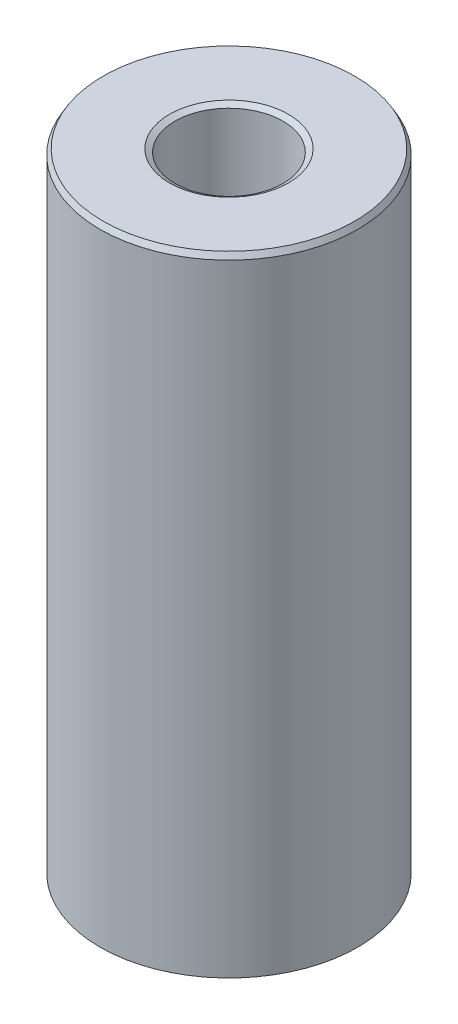
ISO-10303-21;
HEADER;
FILE_DESCRIPTION(('STEP AP214'),'2;1');
FILE_NAME('part.step','',(''),(''),'','','');
FILE_SCHEMA(('AUTOMOTIVE_DESIGN { 1 0 10303 214 1 1 1 1 }'));
ENDSEC;
DATA;
#1=APPLICATION_CONTEXT('core data for automotive mechanical design processes');
#2=APPLICATION_PROTOCOL_DEFINITION('international standard','automotive_design',2000,#1);
#3=PRODUCT_CONTEXT('',#1,'mechanical');
#4=PRODUCT('Part','Part','',(#3));
#5=PRODUCT_RELATED_PRODUCT_CATEGORY('part','',(#4));
#6=PRODUCT_DEFINITION_FORMATION('','',#4);
#7=PRODUCT_DEFINITION_CONTEXT('part definition',#1,'design');
#8=PRODUCT_DEFINITION('design','',#6,#7);
#9=PRODUCT_DEFINITION_SHAPE('','',#8);
#10=(LENGTH_UNIT() NAMED_UNIT(*) SI_UNIT(.MILLI.,.METRE.));
#11=(NAMED_UNIT(*) PLANE_ANGLE_UNIT() SI_UNIT($,.RADIAN.));
#12=(NAMED_UNIT(*) SI_UNIT($,.STERADIAN.) SOLID_ANGLE_UNIT());
#13=UNCERTAINTY_MEASURE_WITH_UNIT(LENGTH_MEASURE(1.E-05),#10,'distance_accuracy_value','');
#14=(GEOMETRIC_REPRESENTATION_CONTEXT(3) GLOBAL_UNCERTAINTY_ASSIGNED_CONTEXT((#13)) GLOBAL_UNIT_ASSIGNED_CONTEXT((#10,
#11,#12)) REPRESENTATION_CONTEXT('',''));
#15=CARTESIAN_POINT('',(0.,0.,0.));
#16=DIRECTION('',(0.,0.,1.));
#17=DIRECTION('',(1.,0.,0.));
#18=AXIS2_PLACEMENT_3D('',#15,#16,#17);
#19=CARTESIAN_POINT('',(0.,232.264597677839,0.));
#20=DIRECTION('',(0.,-1.,0.));
#21=DIRECTION('',(0.,0.,-1.));
#22=AXIS2_PLACEMENT_3D('',#19,#20,#21);
#23=CYLINDRICAL_SURFACE('',#22,47.5);
#24=CARTESIAN_POINT('',(0.,1.16837928120325,0.));
#25=DIRECTION('',(0.,1.,0.));
#26=DIRECTION('',(0.,0.,1.));
#27=AXIS2_PLACEMENT_3D('',#24,#25,#26);
#28=CIRCLE('',#27,47.5);
#29=CARTESIAN_POINT('',(0.,1.16837928120325,47.5));
#30=VERTEX_POINT('',#29);
#31=EDGE_CURVE('E10',#30,#30,#28,.T.);
#32=ORIENTED_EDGE('',*,*,#31,.T.);
#33=EDGE_LOOP('',(#32));
#34=FACE_BOUND('',#33,.T.);
#35=CARTESIAN_POINT('',(0.,230.240905400284,0.));
#36=DIRECTION('',(0.,1.,0.));
#37=DIRECTION('',(0.,0.,1.));
#38=AXIS2_PLACEMENT_3D('',#35,#36,#37);
#39=CIRCLE('',#38,47.5);
#40=CARTESIAN_POINT('',(0.,230.240905400284,47.5));
#41=VERTEX_POINT('',#40);
#42=EDGE_CURVE('E50',#41,#41,#39,.F.);
#43=ORIENTED_EDGE('',*,*,#42,.T.);
#44=EDGE_LOOP('',(#43));
#45=FACE_BOUND('',#44,.T.);
#46=ADVANCED_FACE('F39',(#34,#45),#23,.T.);
#47=CARTESIAN_POINT('',(0.,232.264597677839,0.));
#48=DIRECTION('',(0.,1.,0.));
#49=DIRECTION('',(0.,0.,1.));
#50=AXIS2_PLACEMENT_3D('',#47,#48,#49);
#51=PLANE('',#50);
#52=CARTESIAN_POINT('',(0.,232.264597677839,0.));
#53=DIRECTION('',(0.,1.,0.));
#54=DIRECTION('',(0.,0.,1.));
#55=AXIS2_PLACEMENT_3D('',#52,#53,#54);
#56=CIRCLE('',#55,21.9333346796336);
#57=CARTESIAN_POINT('',(0.,232.264597677839,21.9333346796336));
#58=VERTEX_POINT('',#57);
#59=EDGE_CURVE('E58',#58,#58,#56,.F.);
#60=ORIENTED_EDGE('',*,*,#59,.T.);
#61=EDGE_LOOP('',(#60));
#62=FACE_BOUND('',#61,.T.);
#63=CARTESIAN_POINT('',(0.,232.264597677839,0.));
#64=DIRECTION('',(0.,1.,0.));
#65=DIRECTION('',(0.,0.,1.));
#66=AXIS2_PLACEMENT_3D('',#63,#64,#65);
#67=CIRCLE('',#66,46.3316207187967);
#68=CARTESIAN_POINT('',(0.,232.264597677839,46.3316207187967));
#69=VERTEX_POINT('',#68);
#70=EDGE_CURVE('E61',#69,#69,#67,.T.);
#71=ORIENTED_EDGE('',*,*,#70,.T.);
#72=EDGE_LOOP('',(#71));
#73=FACE_BOUND('',#72,.T.);
#74=ADVANCED_FACE('F88',(#62,#73),#51,.T.);
#75=CARTESIAN_POINT('',(0.,0.,0.));
#76=DIRECTION('',(0.,1.,0.));
#77=DIRECTION('',(0.,0.,1.));
#78=AXIS2_PLACEMENT_3D('',#75,#76,#77);
#79=PLANE('',#78);
#80=CARTESIAN_POINT('',(0.,0.,0.));
#81=DIRECTION('',(0.,1.,0.));
#82=DIRECTION('',(0.,0.,1.));
#83=AXIS2_PLACEMENT_3D('',#80,#81,#82);
#84=CIRCLE('',#83,21.078021683282);
#85=CARTESIAN_POINT('',(0.,0.,21.078021683282));
#86=VERTEX_POINT('',#85);
#87=EDGE_CURVE('E51',#86,#86,#84,.T.);
#88=ORIENTED_EDGE('',*,*,#87,.T.);
#89=EDGE_LOOP('',(#88));
#90=FACE_BOUND('',#89,.T.);
#91=CARTESIAN_POINT('',(0.,0.,0.));
#92=DIRECTION('',(0.,1.,0.));
#93=DIRECTION('',(0.,0.,1.));
#94=AXIS2_PLACEMENT_3D('',#91,#92,#93);
#95=CIRCLE('',#94,45.4763077224452);
#96=CARTESIAN_POINT('',(0.,0.,45.4763077224452));
#97=VERTEX_POINT('',#96);
#98=EDGE_CURVE('E54',#97,#97,#95,.F.);
#99=ORIENTED_EDGE('',*,*,#98,.T.);
#100=EDGE_LOOP('',(#99));
#101=FACE_BOUND('',#100,.T.);
#102=ADVANCED_FACE('F83',(#90,#101),#79,.F.);
#103=CARTESIAN_POINT('',(0.,232.264597677839,0.));
#104=DIRECTION('',(0.,-1.,0.));
#105=DIRECTION('',(0.,0.,-1.));
#106=AXIS2_PLACEMENT_3D('',#103,#104,#105);
#107=CYLINDRICAL_SURFACE('',#106,19.9096424020788);
#108=CARTESIAN_POINT('',(0.,231.096218396636,0.));
#109=DIRECTION('',(0.,1.,0.));
#110=DIRECTION('',(0.,0.,1.));
#111=AXIS2_PLACEMENT_3D('',#108,#109,#110);
#112=CIRCLE('',#111,19.9096424020788);
#113=CARTESIAN_POINT('',(0.,231.096218396636,19.9096424020788));
#114=VERTEX_POINT('',#113);
#115=EDGE_CURVE('E67',#114,#114,#112,.T.);
#116=ORIENTED_EDGE('',*,*,#115,.T.);
#117=EDGE_LOOP('',(#116));
#118=FACE_BOUND('',#117,.T.);
#119=CARTESIAN_POINT('',(0.,2.02369227755483,0.));
#120=DIRECTION('',(0.,1.,0.));
#121=DIRECTION('',(0.,0.,1.));
#122=AXIS2_PLACEMENT_3D('',#119,#120,#121);
#123=CIRCLE('',#122,19.9096424020788);
#124=CARTESIAN_POINT('',(0.,2.02369227755483,19.9096424020788));
#125=VERTEX_POINT('',#124);
#126=EDGE_CURVE('E69',#125,#125,#123,.F.);
#127=ORIENTED_EDGE('',*,*,#126,.T.);
#128=EDGE_LOOP('',(#127));
#129=FACE_BOUND('',#128,.T.);
#130=ADVANCED_FACE('F71',(#118,#129),#107,.F.);
#131=CARTESIAN_POINT('',(0.,231.096218396636,0.));
#132=DIRECTION('',(0.,1.,0.));
#133=DIRECTION('',(0.,0.,1.));
#134=AXIS2_PLACEMENT_3D('',#131,#132,#133);
#135=CONICAL_SURFACE('',#134,19.9096424020788,1.04719755119659);
#136=ORIENTED_EDGE('',*,*,#59,.F.);
#137=EDGE_LOOP('',(#136));
#138=FACE_BOUND('',#137,.T.);
#139=ORIENTED_EDGE('',*,*,#115,.F.);
#140=EDGE_LOOP('',(#139));
#141=FACE_BOUND('',#140,.T.);
#142=ADVANCED_FACE('F77',(#138,#141),#135,.F.);
#143=CARTESIAN_POINT('',(0.,0.,0.));
#144=DIRECTION('',(0.,-1.,0.));
#145=DIRECTION('',(0.,0.,-1.));
#146=AXIS2_PLACEMENT_3D('',#143,#144,#145);
#147=CONICAL_SURFACE('',#146,21.078021683282,0.523598775598297);
#148=ORIENTED_EDGE('',*,*,#126,.F.);
#149=EDGE_LOOP('',(#148));
#150=FACE_BOUND('',#149,.T.);
#151=ORIENTED_EDGE('',*,*,#87,.F.);
#152=EDGE_LOOP('',(#151));
#153=FACE_BOUND('',#152,.T.);
#154=ADVANCED_FACE('F73',(#150,#153),#147,.F.);
#155=CARTESIAN_POINT('',(0.,1.16837928120325,0.));
#156=DIRECTION('',(0.,1.,0.));
#157=DIRECTION('',(0.,0.,1.));
#158=AXIS2_PLACEMENT_3D('',#155,#156,#157);
#159=CONICAL_SURFACE('',#158,47.5,1.04719755119659);
#160=ORIENTED_EDGE('',*,*,#98,.F.);
#161=EDGE_LOOP('',(#160));
#162=FACE_BOUND('',#161,.T.);
#163=ORIENTED_EDGE('',*,*,#31,.F.);
#164=EDGE_LOOP('',(#163));
#165=FACE_BOUND('',#164,.T.);
#166=ADVANCED_FACE('F76',(#162,#165),#159,.T.);
#167=CARTESIAN_POINT('',(0.,232.264597677839,0.));
#168=DIRECTION('',(0.,-1.,0.));
#169=DIRECTION('',(0.,0.,-1.));
#170=AXIS2_PLACEMENT_3D('',#167,#168,#169);
#171=CONICAL_SURFACE('',#170,46.3316207187967,0.5235987755983);
#172=ORIENTED_EDGE('',*,*,#42,.F.);
#173=EDGE_LOOP('',(#172));
#174=FACE_BOUND('',#173,.T.);
#175=ORIENTED_EDGE('',*,*,#70,.F.);
#176=EDGE_LOOP('',(#175));
#177=FACE_BOUND('',#176,.T.);
#178=ADVANCED_FACE('F45',(#174,#177),#171,.T.);
#179=CLOSED_SHELL('',(#46,#74,#102,#130,#142,#154,#166,#178));
#180=MANIFOLD_SOLID_BREP('B2',#179);
#181=ADVANCED_BREP_SHAPE_REPRESENTATION('',(#18,#180),#14);
#182=SHAPE_DEFINITION_REPRESENTATION(#9,#181);
ENDSEC;
END-ISO-10303-21;
